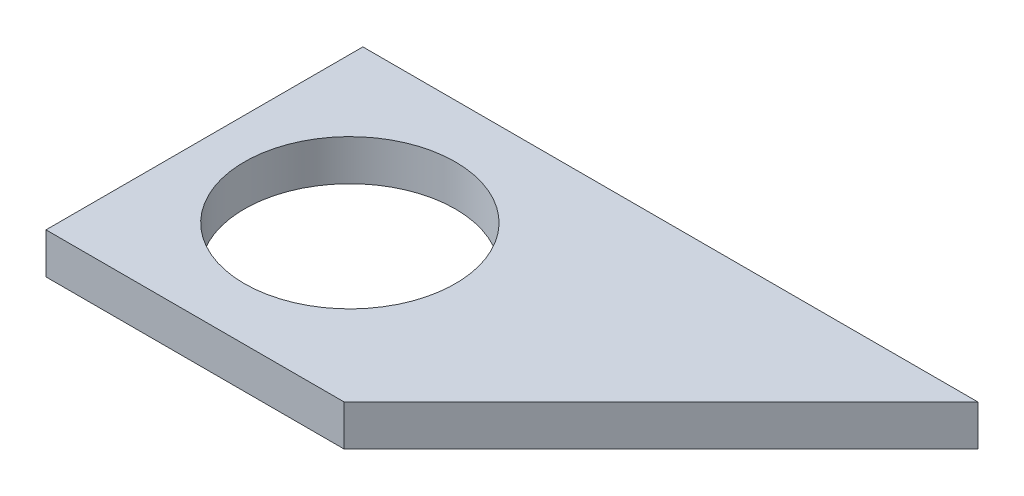
ISO-10303-21;
HEADER;
FILE_DESCRIPTION(('STEP AP214'),'2;1');
FILE_NAME('part.step','',(''),(''),'','','');
FILE_SCHEMA(('AUTOMOTIVE_DESIGN { 1 0 10303 214 1 1 1 1 }'));
ENDSEC;
DATA;
#1=APPLICATION_CONTEXT('core data for automotive mechanical design processes');
#2=APPLICATION_PROTOCOL_DEFINITION('international standard','automotive_design',2000,#1);
#3=PRODUCT_CONTEXT('',#1,'mechanical');
#4=PRODUCT('Part','Part','',(#3));
#5=PRODUCT_RELATED_PRODUCT_CATEGORY('part','',(#4));
#6=PRODUCT_DEFINITION_FORMATION('','',#4);
#7=PRODUCT_DEFINITION_CONTEXT('part definition',#1,'design');
#8=PRODUCT_DEFINITION('design','',#6,#7);
#9=PRODUCT_DEFINITION_SHAPE('','',#8);
#10=(LENGTH_UNIT() NAMED_UNIT(*) SI_UNIT(.MILLI.,.METRE.));
#11=(NAMED_UNIT(*) PLANE_ANGLE_UNIT() SI_UNIT($,.RADIAN.));
#12=(NAMED_UNIT(*) SI_UNIT($,.STERADIAN.) SOLID_ANGLE_UNIT());
#13=UNCERTAINTY_MEASURE_WITH_UNIT(LENGTH_MEASURE(1.E-05),#10,'distance_accuracy_value','');
#14=(GEOMETRIC_REPRESENTATION_CONTEXT(3) GLOBAL_UNCERTAINTY_ASSIGNED_CONTEXT((#13)) GLOBAL_UNIT_ASSIGNED_CONTEXT((#10,
#11,#12)) REPRESENTATION_CONTEXT('',''));
#15=CARTESIAN_POINT('',(0.,0.,0.));
#16=DIRECTION('',(0.,0.,1.));
#17=DIRECTION('',(1.,0.,0.));
#18=AXIS2_PLACEMENT_3D('',#15,#16,#17);
#19=CARTESIAN_POINT('',(0.,5.8,0.));
#20=DIRECTION('',(0.,-1.,0.));
#21=DIRECTION('',(0.,0.,-1.));
#22=AXIS2_PLACEMENT_3D('',#19,#20,#21);
#23=PLANE('',#22);
#24=DIRECTION('',(0.,0.,1.));
#25=VECTOR('',#24,1.);
#26=CARTESIAN_POINT('',(0.,5.8,0.));
#27=LINE('',#26,#25);
#28=CARTESIAN_POINT('',(0.,5.8,-45.05));
#29=VERTEX_POINT('',#28);
#30=CARTESIAN_POINT('',(0.,5.8,0.));
#31=VERTEX_POINT('',#30);
#32=EDGE_CURVE('E83',#29,#31,#27,.T.);
#33=ORIENTED_EDGE('',*,*,#32,.T.);
#34=DIRECTION('',(1.,0.,0.));
#35=VECTOR('',#34,1.);
#36=CARTESIAN_POINT('',(0.,5.8,0.));
#37=LINE('',#36,#35);
#38=CARTESIAN_POINT('',(42.4,5.8,0.));
#39=VERTEX_POINT('',#38);
#40=EDGE_CURVE('E77',#31,#39,#37,.T.);
#41=ORIENTED_EDGE('',*,*,#40,.T.);
#42=DIRECTION('',(0.707106781186546,0.,-0.707106781186549));
#43=VECTOR('',#42,1.);
#44=CARTESIAN_POINT('',(42.4,5.8,0.));
#45=LINE('',#44,#43);
#46=CARTESIAN_POINT('',(87.4499999999998,5.8,-45.05));
#47=VERTEX_POINT('',#46);
#48=EDGE_CURVE('E80',#39,#47,#45,.T.);
#49=ORIENTED_EDGE('',*,*,#48,.T.);
#50=DIRECTION('',(-1.,0.,0.));
#51=VECTOR('',#50,1.);
#52=CARTESIAN_POINT('',(87.4499999999998,5.8,-45.05));
#53=LINE('',#52,#51);
#54=EDGE_CURVE('E49',#47,#29,#53,.T.);
#55=ORIENTED_EDGE('',*,*,#54,.T.);
#56=EDGE_LOOP('',(#33,#41,#49,#55));
#57=FACE_BOUND('',#56,.T.);
#58=CARTESIAN_POINT('',(20.73,5.8,-22.47));
#59=DIRECTION('',(0.,1.,0.));
#60=DIRECTION('',(0.,0.,1.));
#61=AXIS2_PLACEMENT_3D('',#58,#59,#60);
#62=CIRCLE('',#61,15.);
#63=CARTESIAN_POINT('',(20.73,5.8,-7.47000000000001));
#64=VERTEX_POINT('',#63);
#65=EDGE_CURVE('E100',#64,#64,#62,.T.);
#66=ORIENTED_EDGE('',*,*,#65,.F.);
#67=EDGE_LOOP('',(#66));
#68=FACE_BOUND('',#67,.T.);
#69=ADVANCED_FACE('F32',(#57,#68),#23,.F.);
#70=CARTESIAN_POINT('',(0.,0.,0.));
#71=DIRECTION('',(0.,-1.,0.));
#72=DIRECTION('',(0.,0.,-1.));
#73=AXIS2_PLACEMENT_3D('',#70,#71,#72);
#74=PLANE('',#73);
#75=DIRECTION('',(0.,0.,1.));
#76=VECTOR('',#75,1.);
#77=CARTESIAN_POINT('',(0.,0.,0.));
#78=LINE('',#77,#76);
#79=CARTESIAN_POINT('',(0.,0.,-45.05));
#80=VERTEX_POINT('',#79);
#81=CARTESIAN_POINT('',(0.,0.,0.));
#82=VERTEX_POINT('',#81);
#83=EDGE_CURVE('E97',#80,#82,#78,.T.);
#84=ORIENTED_EDGE('',*,*,#83,.F.);
#85=DIRECTION('',(-1.,0.,0.));
#86=VECTOR('',#85,1.);
#87=CARTESIAN_POINT('',(0.,0.,-45.05));
#88=LINE('',#87,#86);
#89=CARTESIAN_POINT('',(87.4499999999998,0.,-45.05));
#90=VERTEX_POINT('',#89);
#91=EDGE_CURVE('E66',#90,#80,#88,.T.);
#92=ORIENTED_EDGE('',*,*,#91,.F.);
#93=DIRECTION('',(0.707106781186546,0.,-0.707106781186549));
#94=VECTOR('',#93,1.);
#95=CARTESIAN_POINT('',(42.4,0.,0.));
#96=LINE('',#95,#94);
#97=CARTESIAN_POINT('',(42.4,0.,0.));
#98=VERTEX_POINT('',#97);
#99=EDGE_CURVE('E102',#98,#90,#96,.T.);
#100=ORIENTED_EDGE('',*,*,#99,.F.);
#101=DIRECTION('',(1.,0.,0.));
#102=VECTOR('',#101,1.);
#103=CARTESIAN_POINT('',(0.,0.,0.));
#104=LINE('',#103,#102);
#105=EDGE_CURVE('E88',#82,#98,#104,.T.);
#106=ORIENTED_EDGE('',*,*,#105,.F.);
#107=EDGE_LOOP('',(#84,#92,#100,#106));
#108=FACE_BOUND('',#107,.T.);
#109=CARTESIAN_POINT('',(20.73,0.,-22.47));
#110=DIRECTION('',(0.,1.,0.));
#111=DIRECTION('',(0.,0.,1.));
#112=AXIS2_PLACEMENT_3D('',#109,#110,#111);
#113=CIRCLE('',#112,15.);
#114=CARTESIAN_POINT('',(20.73,0.,-7.47000000000001));
#115=VERTEX_POINT('',#114);
#116=EDGE_CURVE('E109',#115,#115,#113,.T.);
#117=ORIENTED_EDGE('',*,*,#116,.T.);
#118=EDGE_LOOP('',(#117));
#119=FACE_BOUND('',#118,.T.);
#120=ADVANCED_FACE('F118',(#108,#119),#74,.T.);
#121=CARTESIAN_POINT('',(0.,5.8,0.));
#122=DIRECTION('',(1.,0.,0.));
#123=DIRECTION('',(0.,0.,-1.));
#124=AXIS2_PLACEMENT_3D('',#121,#122,#123);
#125=PLANE('',#124);
#126=ORIENTED_EDGE('',*,*,#83,.T.);
#127=DIRECTION('',(0.,-1.,0.));
#128=VECTOR('',#127,1.);
#129=CARTESIAN_POINT('',(0.,5.8,0.));
#130=LINE('',#129,#128);
#131=EDGE_CURVE('E11',#31,#82,#130,.T.);
#132=ORIENTED_EDGE('',*,*,#131,.F.);
#133=ORIENTED_EDGE('',*,*,#32,.F.);
#134=DIRECTION('',(0.,-1.,0.));
#135=VECTOR('',#134,1.);
#136=CARTESIAN_POINT('',(0.,5.8,-45.05));
#137=LINE('',#136,#135);
#138=EDGE_CURVE('E93',#29,#80,#137,.T.);
#139=ORIENTED_EDGE('',*,*,#138,.T.);
#140=EDGE_LOOP('',(#126,#132,#133,#139));
#141=FACE_BOUND('',#140,.T.);
#142=ADVANCED_FACE('F34',(#141),#125,.F.);
#143=CARTESIAN_POINT('',(0.,5.8,0.));
#144=DIRECTION('',(0.,0.,-1.));
#145=DIRECTION('',(-1.,0.,0.));
#146=AXIS2_PLACEMENT_3D('',#143,#144,#145);
#147=PLANE('',#146);
#148=ORIENTED_EDGE('',*,*,#105,.T.);
#149=DIRECTION('',(0.,-1.,0.));
#150=VECTOR('',#149,1.);
#151=CARTESIAN_POINT('',(42.4,5.8,0.));
#152=LINE('',#151,#150);
#153=EDGE_CURVE('E41',#39,#98,#152,.T.);
#154=ORIENTED_EDGE('',*,*,#153,.F.);
#155=ORIENTED_EDGE('',*,*,#40,.F.);
#156=ORIENTED_EDGE('',*,*,#131,.T.);
#157=EDGE_LOOP('',(#148,#154,#155,#156));
#158=FACE_BOUND('',#157,.T.);
#159=ADVANCED_FACE('F87',(#158),#147,.F.);
#160=CARTESIAN_POINT('',(42.4,5.8,0.));
#161=DIRECTION('',(-0.707106781186549,0.,-0.707106781186546));
#162=DIRECTION('',(-0.707106781186546,0.,0.707106781186549));
#163=AXIS2_PLACEMENT_3D('',#160,#161,#162);
#164=PLANE('',#163);
#165=ORIENTED_EDGE('',*,*,#99,.T.);
#166=DIRECTION('',(0.,-1.,0.));
#167=VECTOR('',#166,1.);
#168=CARTESIAN_POINT('',(87.4499999999998,5.8,-45.05));
#169=LINE('',#168,#167);
#170=EDGE_CURVE('E90',#47,#90,#169,.T.);
#171=ORIENTED_EDGE('',*,*,#170,.F.);
#172=ORIENTED_EDGE('',*,*,#48,.F.);
#173=ORIENTED_EDGE('',*,*,#153,.T.);
#174=EDGE_LOOP('',(#165,#171,#172,#173));
#175=FACE_BOUND('',#174,.T.);
#176=ADVANCED_FACE('F91',(#175),#164,.F.);
#177=CARTESIAN_POINT('',(0.,5.8,-45.05));
#178=DIRECTION('',(0.,0.,1.));
#179=DIRECTION('',(1.,0.,0.));
#180=AXIS2_PLACEMENT_3D('',#177,#178,#179);
#181=PLANE('',#180);
#182=ORIENTED_EDGE('',*,*,#91,.T.);
#183=ORIENTED_EDGE('',*,*,#138,.F.);
#184=ORIENTED_EDGE('',*,*,#54,.F.);
#185=ORIENTED_EDGE('',*,*,#170,.T.);
#186=EDGE_LOOP('',(#182,#183,#184,#185));
#187=FACE_BOUND('',#186,.T.);
#188=ADVANCED_FACE('F106',(#187),#181,.F.);
#189=CARTESIAN_POINT('',(20.73,5.8,-22.47));
#190=DIRECTION('',(0.,-1.,0.));
#191=DIRECTION('',(0.,0.,-1.));
#192=AXIS2_PLACEMENT_3D('',#189,#190,#191);
#193=CYLINDRICAL_SURFACE('',#192,15.);
#194=ORIENTED_EDGE('',*,*,#65,.T.);
#195=EDGE_LOOP('',(#194));
#196=FACE_BOUND('',#195,.T.);
#197=ORIENTED_EDGE('',*,*,#116,.F.);
#198=EDGE_LOOP('',(#197));
#199=FACE_BOUND('',#198,.T.);
#200=ADVANCED_FACE('F115',(#196,#199),#193,.F.);
#201=CLOSED_SHELL('',(#69,#120,#142,#159,#176,#188,#200));
#202=MANIFOLD_SOLID_BREP('B2',#201);
#203=ADVANCED_BREP_SHAPE_REPRESENTATION('',(#18,#202),#14);
#204=SHAPE_DEFINITION_REPRESENTATION(#9,#203);
ENDSEC;
END-ISO-10303-21;
